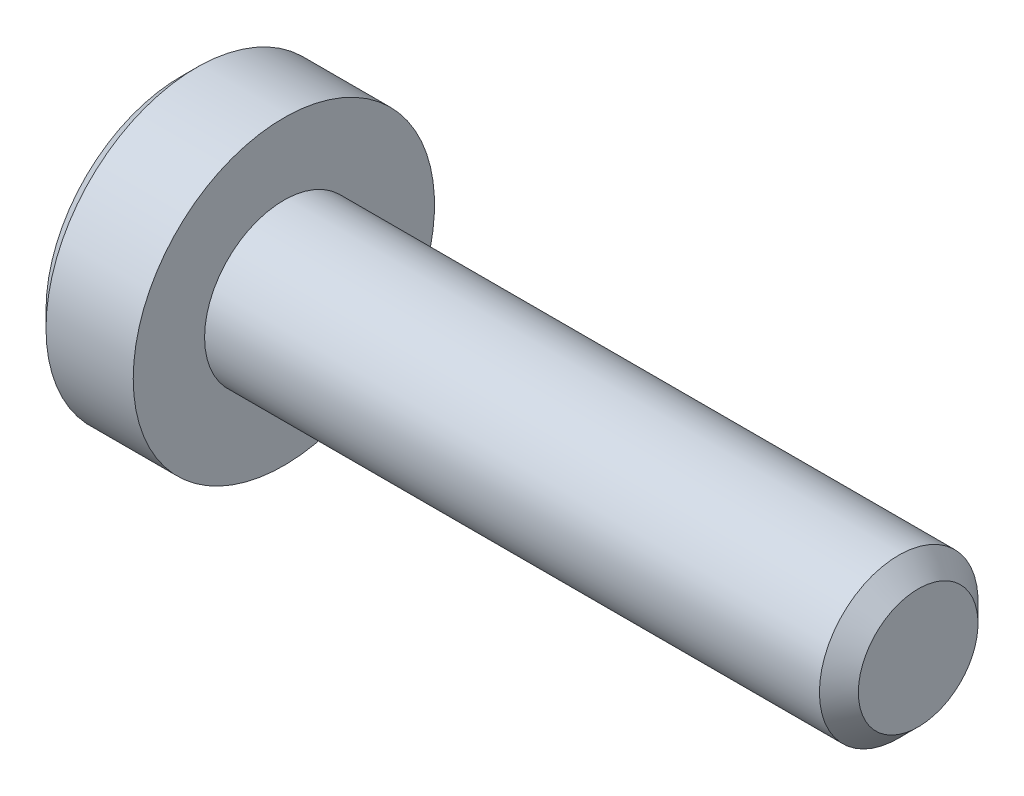
ISO-10303-21;
HEADER;
FILE_DESCRIPTION(('STEP AP214'),'2;1');
FILE_NAME('part.step','',(''),(''),'','','');
FILE_SCHEMA(('AUTOMOTIVE_DESIGN { 1 0 10303 214 1 1 1 1 }'));
ENDSEC;
DATA;
#1=APPLICATION_CONTEXT('core data for automotive mechanical design processes');
#2=APPLICATION_PROTOCOL_DEFINITION('international standard','automotive_design',2000,#1);
#3=PRODUCT_CONTEXT('',#1,'mechanical');
#4=PRODUCT('Part','Part','',(#3));
#5=PRODUCT_RELATED_PRODUCT_CATEGORY('part','',(#4));
#6=PRODUCT_DEFINITION_FORMATION('','',#4);
#7=PRODUCT_DEFINITION_CONTEXT('part definition',#1,'design');
#8=PRODUCT_DEFINITION('design','',#6,#7);
#9=PRODUCT_DEFINITION_SHAPE('','',#8);
#10=(LENGTH_UNIT() NAMED_UNIT(*) SI_UNIT(.MILLI.,.METRE.));
#11=(NAMED_UNIT(*) PLANE_ANGLE_UNIT() SI_UNIT($,.RADIAN.));
#12=(NAMED_UNIT(*) SI_UNIT($,.STERADIAN.) SOLID_ANGLE_UNIT());
#13=UNCERTAINTY_MEASURE_WITH_UNIT(LENGTH_MEASURE(1.E-05),#10,'distance_accuracy_value','');
#14=(GEOMETRIC_REPRESENTATION_CONTEXT(3) GLOBAL_UNCERTAINTY_ASSIGNED_CONTEXT((#13)) GLOBAL_UNIT_ASSIGNED_CONTEXT((#10,
#11,#12)) REPRESENTATION_CONTEXT('',''));
#15=CARTESIAN_POINT('',(0.,0.,0.));
#16=DIRECTION('',(0.,0.,1.));
#17=DIRECTION('',(1.,0.,0.));
#18=AXIS2_PLACEMENT_3D('',#15,#16,#17);
#19=CARTESIAN_POINT('',(-1.3,0.,0.));
#20=DIRECTION('',(1.,0.,0.));
#21=DIRECTION('',(0.,0.,-1.));
#22=AXIS2_PLACEMENT_3D('',#19,#20,#21);
#23=PLANE('',#22);
#24=CARTESIAN_POINT('',(-1.3,0.,0.));
#25=DIRECTION('',(-1.,0.,0.));
#26=DIRECTION('',(0.,0.,1.));
#27=AXIS2_PLACEMENT_3D('',#24,#25,#26);
#28=CIRCLE('',#27,1.7);
#29=CARTESIAN_POINT('',(-1.3,0.,1.7));
#30=VERTEX_POINT('',#29);
#31=EDGE_CURVE('E11',#30,#30,#28,.T.);
#32=ORIENTED_EDGE('',*,*,#31,.T.);
#33=EDGE_LOOP('',(#32));
#34=FACE_BOUND('',#33,.T.);
#35=DIRECTION('',(0.,-1.,0.));
#36=VECTOR('',#35,1.);
#37=CARTESIAN_POINT('',(-1.3,0.37527767497326,0.65));
#38=LINE('',#37,#36);
#39=CARTESIAN_POINT('',(-1.3,0.37527767497326,0.65));
#40=VERTEX_POINT('',#39);
#41=CARTESIAN_POINT('',(-1.3,-0.37527767497326,0.65));
#42=VERTEX_POINT('',#41);
#43=EDGE_CURVE('E53',#40,#42,#38,.T.);
#44=ORIENTED_EDGE('',*,*,#43,.T.);
#45=DIRECTION('',(0.,-0.499999999999993,-0.866025403784442));
#46=VECTOR('',#45,1.);
#47=CARTESIAN_POINT('',(-1.3,-0.37527767497326,0.65));
#48=LINE('',#47,#46);
#49=CARTESIAN_POINT('',(-1.3,-0.75055534994651,0.));
#50=VERTEX_POINT('',#49);
#51=EDGE_CURVE('E124',#42,#50,#48,.T.);
#52=ORIENTED_EDGE('',*,*,#51,.T.);
#53=DIRECTION('',(0.,0.499999999999993,-0.866025403784442));
#54=VECTOR('',#53,1.);
#55=CARTESIAN_POINT('',(-1.3,-0.75055534994651,0.));
#56=LINE('',#55,#54);
#57=CARTESIAN_POINT('',(-1.3,-0.37527767497326,-0.65));
#58=VERTEX_POINT('',#57);
#59=EDGE_CURVE('E127',#50,#58,#56,.T.);
#60=ORIENTED_EDGE('',*,*,#59,.T.);
#61=DIRECTION('',(0.,1.,0.));
#62=VECTOR('',#61,1.);
#63=CARTESIAN_POINT('',(-1.3,-0.37527767497326,-0.65));
#64=LINE('',#63,#62);
#65=CARTESIAN_POINT('',(-1.3,0.37527767497326,-0.65));
#66=VERTEX_POINT('',#65);
#67=EDGE_CURVE('E130',#58,#66,#64,.T.);
#68=ORIENTED_EDGE('',*,*,#67,.T.);
#69=DIRECTION('',(0.,0.499999999999993,0.866025403784442));
#70=VECTOR('',#69,1.);
#71=CARTESIAN_POINT('',(-1.3,0.37527767497326,-0.65));
#72=LINE('',#71,#70);
#73=CARTESIAN_POINT('',(-1.3,0.75055534994651,0.));
#74=VERTEX_POINT('',#73);
#75=EDGE_CURVE('E114',#66,#74,#72,.T.);
#76=ORIENTED_EDGE('',*,*,#75,.T.);
#77=DIRECTION('',(0.,-0.499999999999993,0.866025403784442));
#78=VECTOR('',#77,1.);
#79=CARTESIAN_POINT('',(-1.3,0.75055534994651,0.));
#80=LINE('',#79,#78);
#81=EDGE_CURVE('E133',#74,#40,#80,.T.);
#82=ORIENTED_EDGE('',*,*,#81,.T.);
#83=EDGE_LOOP('',(#44,#52,#60,#68,#76,#82));
#84=FACE_BOUND('',#83,.T.);
#85=ADVANCED_FACE('F39',(#34,#84),#23,.F.);
#86=CARTESIAN_POINT('',(-1.1,0.,0.));
#87=DIRECTION('',(1.,0.,0.));
#88=DIRECTION('',(0.,0.,-1.));
#89=AXIS2_PLACEMENT_3D('',#86,#87,#88);
#90=CONICAL_SURFACE('',#89,1.9,0.785398163397452);
#91=ORIENTED_EDGE('',*,*,#31,.F.);
#92=EDGE_LOOP('',(#91));
#93=FACE_BOUND('',#92,.T.);
#94=CARTESIAN_POINT('',(-1.1,0.,0.));
#95=DIRECTION('',(-1.,0.,0.));
#96=DIRECTION('',(0.,0.,1.));
#97=AXIS2_PLACEMENT_3D('',#94,#95,#96);
#98=CIRCLE('',#97,1.9);
#99=CARTESIAN_POINT('',(-1.1,0.,1.9));
#100=VERTEX_POINT('',#99);
#101=EDGE_CURVE('E46',#100,#100,#98,.T.);
#102=ORIENTED_EDGE('',*,*,#101,.T.);
#103=EDGE_LOOP('',(#102));
#104=FACE_BOUND('',#103,.T.);
#105=ADVANCED_FACE('F158',(#93,#104),#90,.T.);
#106=CARTESIAN_POINT('',(8.,0.,0.));
#107=DIRECTION('',(-1.,0.,0.));
#108=DIRECTION('',(0.,0.,1.));
#109=AXIS2_PLACEMENT_3D('',#106,#107,#108);
#110=CYLINDRICAL_SURFACE('',#109,1.9);
#111=ORIENTED_EDGE('',*,*,#101,.F.);
#112=EDGE_LOOP('',(#111));
#113=FACE_BOUND('',#112,.T.);
#114=CARTESIAN_POINT('',(0.,0.,0.));
#115=DIRECTION('',(-1.,0.,0.));
#116=DIRECTION('',(0.,0.,1.));
#117=AXIS2_PLACEMENT_3D('',#114,#115,#116);
#118=CIRCLE('',#117,1.9);
#119=CARTESIAN_POINT('',(0.,0.,1.9));
#120=VERTEX_POINT('',#119);
#121=EDGE_CURVE('E153',#120,#120,#118,.T.);
#122=ORIENTED_EDGE('',*,*,#121,.T.);
#123=EDGE_LOOP('',(#122));
#124=FACE_BOUND('',#123,.T.);
#125=ADVANCED_FACE('F160',(#113,#124),#110,.T.);
#126=CARTESIAN_POINT('',(0.,1.9,0.));
#127=DIRECTION('',(-1.,0.,0.));
#128=DIRECTION('',(0.,0.,1.));
#129=AXIS2_PLACEMENT_3D('',#126,#127,#128);
#130=PLANE('',#129);
#131=ORIENTED_EDGE('',*,*,#121,.F.);
#132=EDGE_LOOP('',(#131));
#133=FACE_BOUND('',#132,.T.);
#134=CARTESIAN_POINT('',(0.,0.,0.));
#135=DIRECTION('',(-1.,0.,0.));
#136=DIRECTION('',(0.,0.,1.));
#137=AXIS2_PLACEMENT_3D('',#134,#135,#136);
#138=CIRCLE('',#137,1.);
#139=CARTESIAN_POINT('',(0.,0.,1.));
#140=VERTEX_POINT('',#139);
#141=EDGE_CURVE('E150',#140,#140,#138,.T.);
#142=ORIENTED_EDGE('',*,*,#141,.T.);
#143=EDGE_LOOP('',(#142));
#144=FACE_BOUND('',#143,.T.);
#145=ADVANCED_FACE('F163',(#133,#144),#130,.F.);
#146=CARTESIAN_POINT('',(8.,0.,0.));
#147=DIRECTION('',(-1.,0.,0.));
#148=DIRECTION('',(0.,0.,1.));
#149=AXIS2_PLACEMENT_3D('',#146,#147,#148);
#150=CYLINDRICAL_SURFACE('',#149,1.);
#151=ORIENTED_EDGE('',*,*,#141,.F.);
#152=EDGE_LOOP('',(#151));
#153=FACE_BOUND('',#152,.T.);
#154=CARTESIAN_POINT('',(7.7545,0.,0.));
#155=DIRECTION('',(-1.,0.,0.));
#156=DIRECTION('',(0.,0.,1.));
#157=AXIS2_PLACEMENT_3D('',#154,#155,#156);
#158=CIRCLE('',#157,1.);
#159=CARTESIAN_POINT('',(7.7545,0.,1.));
#160=VERTEX_POINT('',#159);
#161=EDGE_CURVE('E147',#160,#160,#158,.T.);
#162=ORIENTED_EDGE('',*,*,#161,.T.);
#163=EDGE_LOOP('',(#162));
#164=FACE_BOUND('',#163,.T.);
#165=ADVANCED_FACE('F169',(#153,#164),#150,.T.);
#166=CARTESIAN_POINT('',(8.,0.,0.));
#167=DIRECTION('',(-1.,0.,0.));
#168=DIRECTION('',(0.,0.,1.));
#169=AXIS2_PLACEMENT_3D('',#166,#167,#168);
#170=CONICAL_SURFACE('',#169,0.7545,0.785398163397448);
#171=ORIENTED_EDGE('',*,*,#161,.F.);
#172=EDGE_LOOP('',(#171));
#173=FACE_BOUND('',#172,.T.);
#174=CARTESIAN_POINT('',(8.,0.,0.));
#175=DIRECTION('',(-1.,0.,0.));
#176=DIRECTION('',(0.,0.,1.));
#177=AXIS2_PLACEMENT_3D('',#174,#175,#176);
#178=CIRCLE('',#177,0.7545);
#179=CARTESIAN_POINT('',(8.,0.,0.7545));
#180=VERTEX_POINT('',#179);
#181=EDGE_CURVE('E144',#180,#180,#178,.T.);
#182=ORIENTED_EDGE('',*,*,#181,.T.);
#183=EDGE_LOOP('',(#182));
#184=FACE_BOUND('',#183,.T.);
#185=ADVANCED_FACE('F175',(#173,#184),#170,.T.);
#186=CARTESIAN_POINT('',(8.,0.7545,0.));
#187=DIRECTION('',(-1.,0.,0.));
#188=DIRECTION('',(0.,0.,1.));
#189=AXIS2_PLACEMENT_3D('',#186,#187,#188);
#190=PLANE('',#189);
#191=ORIENTED_EDGE('',*,*,#181,.F.);
#192=EDGE_LOOP('',(#191));
#193=FACE_BOUND('',#192,.T.);
#194=ADVANCED_FACE('F181',(#193),#190,.F.);
#195=CARTESIAN_POINT('',(-0.6,0.37527767497326,0.65));
#196=DIRECTION('',(0.,0.,-1.));
#197=DIRECTION('',(-1.,0.,0.));
#198=AXIS2_PLACEMENT_3D('',#195,#196,#197);
#199=PLANE('',#198);
#200=ORIENTED_EDGE('',*,*,#43,.F.);
#201=DIRECTION('',(-1.,0.,0.));
#202=VECTOR('',#201,1.);
#203=CARTESIAN_POINT('',(-0.6,0.37527767497326,0.65));
#204=LINE('',#203,#202);
#205=CARTESIAN_POINT('',(-0.6,0.37527767497326,0.65));
#206=VERTEX_POINT('',#205);
#207=EDGE_CURVE('E119',#206,#40,#204,.T.);
#208=ORIENTED_EDGE('',*,*,#207,.F.);
#209=DIRECTION('',(0.,-1.,0.));
#210=VECTOR('',#209,1.);
#211=CARTESIAN_POINT('',(-0.6,0.37527767497326,0.65));
#212=LINE('',#211,#210);
#213=CARTESIAN_POINT('',(-0.6,-0.37527767497326,0.65));
#214=VERTEX_POINT('',#213);
#215=EDGE_CURVE('E136',#206,#214,#212,.T.);
#216=ORIENTED_EDGE('',*,*,#215,.T.);
#217=DIRECTION('',(-1.,0.,0.));
#218=VECTOR('',#217,1.);
#219=CARTESIAN_POINT('',(-0.6,-0.37527767497326,0.65));
#220=LINE('',#219,#218);
#221=EDGE_CURVE('E142',#214,#42,#220,.T.);
#222=ORIENTED_EDGE('',*,*,#221,.T.);
#223=EDGE_LOOP('',(#200,#208,#216,#222));
#224=FACE_BOUND('',#223,.T.);
#225=ADVANCED_FACE('F186',(#224),#199,.T.);
#226=CARTESIAN_POINT('',(-0.6,-0.37527767497326,0.65));
#227=DIRECTION('',(0.,0.866025403784442,-0.499999999999993));
#228=DIRECTION('',(0.,0.499999999999993,0.866025403784442));
#229=AXIS2_PLACEMENT_3D('',#226,#227,#228);
#230=PLANE('',#229);
#231=ORIENTED_EDGE('',*,*,#51,.F.);
#232=ORIENTED_EDGE('',*,*,#221,.F.);
#233=DIRECTION('',(0.,-0.499999999999993,-0.866025403784442));
#234=VECTOR('',#233,1.);
#235=CARTESIAN_POINT('',(-0.6,-0.37527767497326,0.65));
#236=LINE('',#235,#234);
#237=CARTESIAN_POINT('',(-0.6,-0.75055534994651,0.));
#238=VERTEX_POINT('',#237);
#239=EDGE_CURVE('E92',#214,#238,#236,.T.);
#240=ORIENTED_EDGE('',*,*,#239,.T.);
#241=DIRECTION('',(-1.,0.,0.));
#242=VECTOR('',#241,1.);
#243=CARTESIAN_POINT('',(-0.6,-0.75055534994651,0.));
#244=LINE('',#243,#242);
#245=EDGE_CURVE('E140',#238,#50,#244,.T.);
#246=ORIENTED_EDGE('',*,*,#245,.T.);
#247=EDGE_LOOP('',(#231,#232,#240,#246));
#248=FACE_BOUND('',#247,.T.);
#249=ADVANCED_FACE('F191',(#248),#230,.T.);
#250=CARTESIAN_POINT('',(-0.6,-0.75055534994651,0.));
#251=DIRECTION('',(0.,0.866025403784442,0.499999999999993));
#252=DIRECTION('',(0.,-0.499999999999993,0.866025403784442));
#253=AXIS2_PLACEMENT_3D('',#250,#251,#252);
#254=PLANE('',#253);
#255=ORIENTED_EDGE('',*,*,#59,.F.);
#256=ORIENTED_EDGE('',*,*,#245,.F.);
#257=DIRECTION('',(0.,0.499999999999993,-0.866025403784442));
#258=VECTOR('',#257,1.);
#259=CARTESIAN_POINT('',(-0.6,-0.75055534994651,0.));
#260=LINE('',#259,#258);
#261=CARTESIAN_POINT('',(-0.6,-0.37527767497326,-0.65));
#262=VERTEX_POINT('',#261);
#263=EDGE_CURVE('E110',#238,#262,#260,.T.);
#264=ORIENTED_EDGE('',*,*,#263,.T.);
#265=DIRECTION('',(-1.,0.,0.));
#266=VECTOR('',#265,1.);
#267=CARTESIAN_POINT('',(-0.6,-0.37527767497326,-0.65));
#268=LINE('',#267,#266);
#269=EDGE_CURVE('E107',#262,#58,#268,.T.);
#270=ORIENTED_EDGE('',*,*,#269,.T.);
#271=EDGE_LOOP('',(#255,#256,#264,#270));
#272=FACE_BOUND('',#271,.T.);
#273=ADVANCED_FACE('F208',(#272),#254,.T.);
#274=CARTESIAN_POINT('',(-0.6,-0.37527767497326,-0.65));
#275=DIRECTION('',(0.,0.,1.));
#276=DIRECTION('',(1.,0.,0.));
#277=AXIS2_PLACEMENT_3D('',#274,#275,#276);
#278=PLANE('',#277);
#279=ORIENTED_EDGE('',*,*,#67,.F.);
#280=ORIENTED_EDGE('',*,*,#269,.F.);
#281=DIRECTION('',(0.,1.,0.));
#282=VECTOR('',#281,1.);
#283=CARTESIAN_POINT('',(-0.6,-0.37527767497326,-0.65));
#284=LINE('',#283,#282);
#285=CARTESIAN_POINT('',(-0.6,0.37527767497326,-0.65));
#286=VERTEX_POINT('',#285);
#287=EDGE_CURVE('E102',#262,#286,#284,.T.);
#288=ORIENTED_EDGE('',*,*,#287,.T.);
#289=DIRECTION('',(-1.,0.,0.));
#290=VECTOR('',#289,1.);
#291=CARTESIAN_POINT('',(-0.6,0.37527767497326,-0.65));
#292=LINE('',#291,#290);
#293=EDGE_CURVE('E106',#286,#66,#292,.T.);
#294=ORIENTED_EDGE('',*,*,#293,.T.);
#295=EDGE_LOOP('',(#279,#280,#288,#294));
#296=FACE_BOUND('',#295,.T.);
#297=ADVANCED_FACE('F105',(#296),#278,.T.);
#298=CARTESIAN_POINT('',(-0.6,0.37527767497326,-0.65));
#299=DIRECTION('',(0.,-0.866025403784442,0.499999999999993));
#300=DIRECTION('',(0.,-0.499999999999993,-0.866025403784442));
#301=AXIS2_PLACEMENT_3D('',#298,#299,#300);
#302=PLANE('',#301);
#303=ORIENTED_EDGE('',*,*,#75,.F.);
#304=ORIENTED_EDGE('',*,*,#293,.F.);
#305=DIRECTION('',(0.,0.499999999999993,0.866025403784442));
#306=VECTOR('',#305,1.);
#307=CARTESIAN_POINT('',(-0.6,0.37527767497326,-0.65));
#308=LINE('',#307,#306);
#309=CARTESIAN_POINT('',(-0.6,0.75055534994651,0.));
#310=VERTEX_POINT('',#309);
#311=EDGE_CURVE('E109',#286,#310,#308,.T.);
#312=ORIENTED_EDGE('',*,*,#311,.T.);
#313=DIRECTION('',(-1.,0.,0.));
#314=VECTOR('',#313,1.);
#315=CARTESIAN_POINT('',(-0.6,0.75055534994651,0.));
#316=LINE('',#315,#314);
#317=EDGE_CURVE('E83',#310,#74,#316,.T.);
#318=ORIENTED_EDGE('',*,*,#317,.T.);
#319=EDGE_LOOP('',(#303,#304,#312,#318));
#320=FACE_BOUND('',#319,.T.);
#321=ADVANCED_FACE('F112',(#320),#302,.T.);
#322=CARTESIAN_POINT('',(-0.6,0.75055534994651,0.));
#323=DIRECTION('',(0.,-0.866025403784442,-0.499999999999993));
#324=DIRECTION('',(0.,0.499999999999993,-0.866025403784442));
#325=AXIS2_PLACEMENT_3D('',#322,#323,#324);
#326=PLANE('',#325);
#327=ORIENTED_EDGE('',*,*,#81,.F.);
#328=ORIENTED_EDGE('',*,*,#317,.F.);
#329=DIRECTION('',(0.,-0.499999999999993,0.866025403784442));
#330=VECTOR('',#329,1.);
#331=CARTESIAN_POINT('',(-0.6,0.75055534994651,0.));
#332=LINE('',#331,#330);
#333=EDGE_CURVE('E61',#310,#206,#332,.T.);
#334=ORIENTED_EDGE('',*,*,#333,.T.);
#335=ORIENTED_EDGE('',*,*,#207,.T.);
#336=EDGE_LOOP('',(#327,#328,#334,#335));
#337=FACE_BOUND('',#336,.T.);
#338=ADVANCED_FACE('F201',(#337),#326,.T.);
#339=CARTESIAN_POINT('',(-0.6,0.,0.));
#340=DIRECTION('',(1.,0.,0.));
#341=DIRECTION('',(0.,0.,-1.));
#342=AXIS2_PLACEMENT_3D('',#339,#340,#341);
#343=PLANE('',#342);
#344=ORIENTED_EDGE('',*,*,#215,.F.);
#345=ORIENTED_EDGE('',*,*,#333,.F.);
#346=ORIENTED_EDGE('',*,*,#311,.F.);
#347=ORIENTED_EDGE('',*,*,#287,.F.);
#348=ORIENTED_EDGE('',*,*,#263,.F.);
#349=ORIENTED_EDGE('',*,*,#239,.F.);
#350=EDGE_LOOP('',(#344,#345,#346,#347,#348,#349));
#351=FACE_BOUND('',#350,.T.);
#352=ADVANCED_FACE('F117',(#351),#343,.F.);
#353=CLOSED_SHELL('',(#85,#105,#125,#145,#165,#185,#194,#225,#249,#273,#297,#321,#338,#352));
#354=MANIFOLD_SOLID_BREP('B2',#353);
#355=ADVANCED_BREP_SHAPE_REPRESENTATION('',(#18,#354),#14);
#356=SHAPE_DEFINITION_REPRESENTATION(#9,#355);
ENDSEC;
END-ISO-10303-21;
